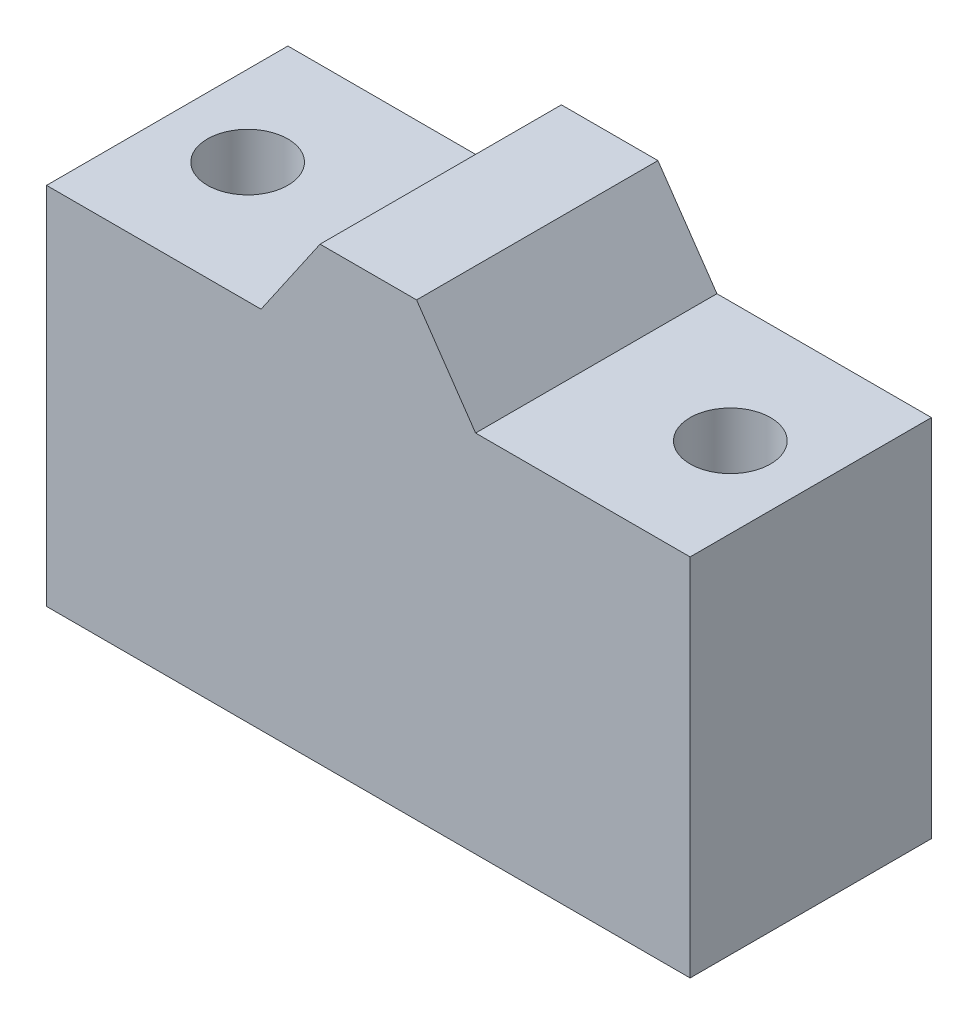
ISO-10303-21;
HEADER;
FILE_DESCRIPTION(('STEP AP214'),'2;1');
FILE_NAME('part.step','',(''),(''),'','','');
FILE_SCHEMA(('AUTOMOTIVE_DESIGN { 1 0 10303 214 1 1 1 1 }'));
ENDSEC;
DATA;
#1=APPLICATION_CONTEXT('core data for automotive mechanical design processes');
#2=APPLICATION_PROTOCOL_DEFINITION('international standard','automotive_design',2000,#1);
#3=PRODUCT_CONTEXT('',#1,'mechanical');
#4=PRODUCT('Part','Part','',(#3));
#5=PRODUCT_RELATED_PRODUCT_CATEGORY('part','',(#4));
#6=PRODUCT_DEFINITION_FORMATION('','',#4);
#7=PRODUCT_DEFINITION_CONTEXT('part definition',#1,'design');
#8=PRODUCT_DEFINITION('design','',#6,#7);
#9=PRODUCT_DEFINITION_SHAPE('','',#8);
#10=(LENGTH_UNIT() NAMED_UNIT(*) SI_UNIT(.MILLI.,.METRE.));
#11=(NAMED_UNIT(*) PLANE_ANGLE_UNIT() SI_UNIT($,.RADIAN.));
#12=(NAMED_UNIT(*) SI_UNIT($,.STERADIAN.) SOLID_ANGLE_UNIT());
#13=UNCERTAINTY_MEASURE_WITH_UNIT(LENGTH_MEASURE(1.E-05),#10,'distance_accuracy_value','');
#14=(GEOMETRIC_REPRESENTATION_CONTEXT(3) GLOBAL_UNCERTAINTY_ASSIGNED_CONTEXT((#13)) GLOBAL_UNIT_ASSIGNED_CONTEXT((#10,
#11,#12)) REPRESENTATION_CONTEXT('',''));
#15=CARTESIAN_POINT('',(0.,0.,0.));
#16=DIRECTION('',(0.,0.,1.));
#17=DIRECTION('',(1.,0.,0.));
#18=AXIS2_PLACEMENT_3D('',#15,#16,#17);
#19=CARTESIAN_POINT('',(0.,68.,45.));
#20=DIRECTION('',(1.,0.,0.));
#21=DIRECTION('',(0.,1.,0.));
#22=AXIS2_PLACEMENT_3D('',#19,#20,#21);
#23=PLANE('',#22);
#24=DIRECTION('',(0.,-1.,0.));
#25=VECTOR('',#24,1.);
#26=CARTESIAN_POINT('',(0.,68.,0.));
#27=LINE('',#26,#25);
#28=CARTESIAN_POINT('',(0.,68.,0.));
#29=VERTEX_POINT('',#28);
#30=CARTESIAN_POINT('',(0.,0.,0.));
#31=VERTEX_POINT('',#30);
#32=EDGE_CURVE('E129',#29,#31,#27,.T.);
#33=ORIENTED_EDGE('',*,*,#32,.T.);
#34=DIRECTION('',(0.,0.,-1.));
#35=VECTOR('',#34,1.);
#36=CARTESIAN_POINT('',(0.,0.,45.));
#37=LINE('',#36,#35);
#38=CARTESIAN_POINT('',(0.,0.,45.));
#39=VERTEX_POINT('',#38);
#40=EDGE_CURVE('E11',#39,#31,#37,.T.);
#41=ORIENTED_EDGE('',*,*,#40,.F.);
#42=DIRECTION('',(0.,-1.,0.));
#43=VECTOR('',#42,1.);
#44=CARTESIAN_POINT('',(0.,68.,45.));
#45=LINE('',#44,#43);
#46=CARTESIAN_POINT('',(0.,68.,45.));
#47=VERTEX_POINT('',#46);
#48=EDGE_CURVE('E144',#47,#39,#45,.T.);
#49=ORIENTED_EDGE('',*,*,#48,.F.);
#50=DIRECTION('',(0.,0.,-1.));
#51=VECTOR('',#50,1.);
#52=CARTESIAN_POINT('',(0.,68.,45.));
#53=LINE('',#52,#51);
#54=EDGE_CURVE('E125',#47,#29,#53,.T.);
#55=ORIENTED_EDGE('',*,*,#54,.T.);
#56=EDGE_LOOP('',(#33,#41,#49,#55));
#57=FACE_BOUND('',#56,.T.);
#58=ADVANCED_FACE('F33',(#57),#23,.F.);
#59=CARTESIAN_POINT('',(0.,0.,45.));
#60=DIRECTION('',(0.,1.,0.));
#61=DIRECTION('',(0.,0.,1.));
#62=AXIS2_PLACEMENT_3D('',#59,#60,#61);
#63=PLANE('',#62);
#64=CARTESIAN_POINT('',(15.0000000000001,0.,22.5));
#65=DIRECTION('',(0.,1.,0.));
#66=DIRECTION('',(-1.,0.,0.));
#67=AXIS2_PLACEMENT_3D('',#64,#65,#66);
#68=CIRCLE('',#67,7.5);
#69=CARTESIAN_POINT('',(7.50000000000008,0.,22.5));
#70=VERTEX_POINT('',#69);
#71=EDGE_CURVE('E180',#70,#70,#68,.T.);
#72=ORIENTED_EDGE('',*,*,#71,.T.);
#73=EDGE_LOOP('',(#72));
#74=FACE_BOUND('',#73,.T.);
#75=CARTESIAN_POINT('',(105.,0.,22.5));
#76=DIRECTION('',(0.,1.,0.));
#77=DIRECTION('',(-1.,0.,0.));
#78=AXIS2_PLACEMENT_3D('',#75,#76,#77);
#79=CIRCLE('',#78,7.5);
#80=CARTESIAN_POINT('',(97.5000000000001,0.,22.5));
#81=VERTEX_POINT('',#80);
#82=EDGE_CURVE('E133',#81,#81,#79,.T.);
#83=ORIENTED_EDGE('',*,*,#82,.T.);
#84=EDGE_LOOP('',(#83));
#85=FACE_BOUND('',#84,.T.);
#86=DIRECTION('',(1.,0.,0.));
#87=VECTOR('',#86,1.);
#88=CARTESIAN_POINT('',(0.,0.,0.));
#89=LINE('',#88,#87);
#90=CARTESIAN_POINT('',(120.,0.,0.));
#91=VERTEX_POINT('',#90);
#92=EDGE_CURVE('E132',#31,#91,#89,.T.);
#93=ORIENTED_EDGE('',*,*,#92,.T.);
#94=DIRECTION('',(0.,0.,-1.));
#95=VECTOR('',#94,1.);
#96=CARTESIAN_POINT('',(120.,0.,45.));
#97=LINE('',#96,#95);
#98=CARTESIAN_POINT('',(120.,0.,45.));
#99=VERTEX_POINT('',#98);
#100=EDGE_CURVE('E41',#99,#91,#97,.T.);
#101=ORIENTED_EDGE('',*,*,#100,.F.);
#102=DIRECTION('',(1.,0.,0.));
#103=VECTOR('',#102,1.);
#104=CARTESIAN_POINT('',(0.,0.,45.));
#105=LINE('',#104,#103);
#106=EDGE_CURVE('E92',#39,#99,#105,.T.);
#107=ORIENTED_EDGE('',*,*,#106,.F.);
#108=ORIENTED_EDGE('',*,*,#40,.T.);
#109=EDGE_LOOP('',(#93,#101,#107,#108));
#110=FACE_BOUND('',#109,.T.);
#111=ADVANCED_FACE('F189',(#74,#85,#110),#63,.F.);
#112=CARTESIAN_POINT('',(120.,0.,45.));
#113=DIRECTION('',(-1.,0.,0.));
#114=DIRECTION('',(0.,0.,1.));
#115=AXIS2_PLACEMENT_3D('',#112,#113,#114);
#116=PLANE('',#115);
#117=DIRECTION('',(0.,1.,0.));
#118=VECTOR('',#117,1.);
#119=CARTESIAN_POINT('',(120.,0.,0.));
#120=LINE('',#119,#118);
#121=CARTESIAN_POINT('',(120.,68.,0.));
#122=VERTEX_POINT('',#121);
#123=EDGE_CURVE('E135',#91,#122,#120,.T.);
#124=ORIENTED_EDGE('',*,*,#123,.T.);
#125=DIRECTION('',(0.,0.,-1.));
#126=VECTOR('',#125,1.);
#127=CARTESIAN_POINT('',(120.,68.,45.));
#128=LINE('',#127,#126);
#129=CARTESIAN_POINT('',(120.,68.,45.));
#130=VERTEX_POINT('',#129);
#131=EDGE_CURVE('E151',#130,#122,#128,.T.);
#132=ORIENTED_EDGE('',*,*,#131,.F.);
#133=DIRECTION('',(0.,1.,0.));
#134=VECTOR('',#133,1.);
#135=CARTESIAN_POINT('',(120.,0.,45.));
#136=LINE('',#135,#134);
#137=EDGE_CURVE('E159',#99,#130,#136,.T.);
#138=ORIENTED_EDGE('',*,*,#137,.F.);
#139=ORIENTED_EDGE('',*,*,#100,.T.);
#140=EDGE_LOOP('',(#124,#132,#138,#139));
#141=FACE_BOUND('',#140,.T.);
#142=ADVANCED_FACE('F157',(#141),#116,.F.);
#143=CARTESIAN_POINT('',(120.,68.,45.));
#144=DIRECTION('',(0.,-1.,0.));
#145=DIRECTION('',(1.,0.,0.));
#146=AXIS2_PLACEMENT_3D('',#143,#144,#145);
#147=PLANE('',#146);
#148=CARTESIAN_POINT('',(105.,68.0000000000001,22.5));
#149=DIRECTION('',(0.,1.,0.));
#150=DIRECTION('',(-1.,0.,0.));
#151=AXIS2_PLACEMENT_3D('',#148,#149,#150);
#152=CIRCLE('',#151,7.5);
#153=CARTESIAN_POINT('',(97.5,68.0000000000001,22.5));
#154=VERTEX_POINT('',#153);
#155=EDGE_CURVE('E177',#154,#154,#152,.T.);
#156=ORIENTED_EDGE('',*,*,#155,.F.);
#157=EDGE_LOOP('',(#156));
#158=FACE_BOUND('',#157,.T.);
#159=DIRECTION('',(-1.,0.,0.));
#160=VECTOR('',#159,1.);
#161=CARTESIAN_POINT('',(120.,68.,0.));
#162=LINE('',#161,#160);
#163=CARTESIAN_POINT('',(80.,68.,0.));
#164=VERTEX_POINT('',#163);
#165=EDGE_CURVE('E137',#122,#164,#162,.T.);
#166=ORIENTED_EDGE('',*,*,#165,.T.);
#167=DIRECTION('',(0.,0.,-1.));
#168=VECTOR('',#167,1.);
#169=CARTESIAN_POINT('',(80.,68.,45.));
#170=LINE('',#169,#168);
#171=CARTESIAN_POINT('',(80.,68.,45.));
#172=VERTEX_POINT('',#171);
#173=EDGE_CURVE('E148',#172,#164,#170,.T.);
#174=ORIENTED_EDGE('',*,*,#173,.F.);
#175=DIRECTION('',(-1.,0.,0.));
#176=VECTOR('',#175,1.);
#177=CARTESIAN_POINT('',(120.,68.,45.));
#178=LINE('',#177,#176);
#179=EDGE_CURVE('E171',#130,#172,#178,.T.);
#180=ORIENTED_EDGE('',*,*,#179,.F.);
#181=ORIENTED_EDGE('',*,*,#131,.T.);
#182=EDGE_LOOP('',(#166,#174,#180,#181));
#183=FACE_BOUND('',#182,.T.);
#184=ADVANCED_FACE('F167',(#158,#183),#147,.F.);
#185=CARTESIAN_POINT('',(80.,68.,45.));
#186=DIRECTION('',(-0.824041924199367,-0.566528822887066,0.));
#187=DIRECTION('',(0.566528822887066,-0.824041924199367,0.));
#188=AXIS2_PLACEMENT_3D('',#185,#186,#187);
#189=PLANE('',#188);
#190=DIRECTION('',(-0.566528822887066,0.824041924199367,0.));
#191=VECTOR('',#190,1.);
#192=CARTESIAN_POINT('',(80.,68.,0.));
#193=LINE('',#192,#191);
#194=CARTESIAN_POINT('',(69.,84.,0.));
#195=VERTEX_POINT('',#194);
#196=EDGE_CURVE('E139',#164,#195,#193,.T.);
#197=ORIENTED_EDGE('',*,*,#196,.T.);
#198=DIRECTION('',(0.,0.,-1.));
#199=VECTOR('',#198,1.);
#200=CARTESIAN_POINT('',(69.,84.,45.));
#201=LINE('',#200,#199);
#202=CARTESIAN_POINT('',(69.,84.,45.));
#203=VERTEX_POINT('',#202);
#204=EDGE_CURVE('E120',#203,#195,#201,.T.);
#205=ORIENTED_EDGE('',*,*,#204,.F.);
#206=DIRECTION('',(-0.566528822887066,0.824041924199367,0.));
#207=VECTOR('',#206,1.);
#208=CARTESIAN_POINT('',(80.,68.,45.));
#209=LINE('',#208,#207);
#210=EDGE_CURVE('E111',#172,#203,#209,.T.);
#211=ORIENTED_EDGE('',*,*,#210,.F.);
#212=ORIENTED_EDGE('',*,*,#173,.T.);
#213=EDGE_LOOP('',(#197,#205,#211,#212));
#214=FACE_BOUND('',#213,.T.);
#215=ADVANCED_FACE('F170',(#214),#189,.F.);
#216=CARTESIAN_POINT('',(69.,84.,45.));
#217=DIRECTION('',(0.,-1.,0.));
#218=DIRECTION('',(0.,0.,-1.));
#219=AXIS2_PLACEMENT_3D('',#216,#217,#218);
#220=PLANE('',#219);
#221=DIRECTION('',(-1.,0.,0.));
#222=VECTOR('',#221,1.);
#223=CARTESIAN_POINT('',(69.,84.,0.));
#224=LINE('',#223,#222);
#225=CARTESIAN_POINT('',(51.,84.,0.));
#226=VERTEX_POINT('',#225);
#227=EDGE_CURVE('E119',#195,#226,#224,.T.);
#228=ORIENTED_EDGE('',*,*,#227,.T.);
#229=DIRECTION('',(0.,0.,-1.));
#230=VECTOR('',#229,1.);
#231=CARTESIAN_POINT('',(51.,84.,45.));
#232=LINE('',#231,#230);
#233=CARTESIAN_POINT('',(51.,84.,45.));
#234=VERTEX_POINT('',#233);
#235=EDGE_CURVE('E116',#234,#226,#232,.T.);
#236=ORIENTED_EDGE('',*,*,#235,.F.);
#237=DIRECTION('',(-1.,0.,0.));
#238=VECTOR('',#237,1.);
#239=CARTESIAN_POINT('',(69.,84.,45.));
#240=LINE('',#239,#238);
#241=EDGE_CURVE('E105',#203,#234,#240,.T.);
#242=ORIENTED_EDGE('',*,*,#241,.F.);
#243=ORIENTED_EDGE('',*,*,#204,.T.);
#244=EDGE_LOOP('',(#228,#236,#242,#243));
#245=FACE_BOUND('',#244,.T.);
#246=ADVANCED_FACE('F117',(#245),#220,.F.);
#247=CARTESIAN_POINT('',(51.,84.,45.));
#248=DIRECTION('',(0.824041924199367,-0.566528822887066,0.));
#249=DIRECTION('',(0.566528822887066,0.824041924199368,0.));
#250=AXIS2_PLACEMENT_3D('',#247,#248,#249);
#251=PLANE('',#250);
#252=DIRECTION('',(-0.566528822887066,-0.824041924199367,0.));
#253=VECTOR('',#252,1.);
#254=CARTESIAN_POINT('',(51.,84.,0.));
#255=LINE('',#254,#253);
#256=CARTESIAN_POINT('',(40.,68.,0.));
#257=VERTEX_POINT('',#256);
#258=EDGE_CURVE('E78',#226,#257,#255,.T.);
#259=ORIENTED_EDGE('',*,*,#258,.T.);
#260=DIRECTION('',(0.,0.,-1.));
#261=VECTOR('',#260,1.);
#262=CARTESIAN_POINT('',(40.,68.,45.));
#263=LINE('',#262,#261);
#264=CARTESIAN_POINT('',(40.,68.,45.));
#265=VERTEX_POINT('',#264);
#266=EDGE_CURVE('E121',#265,#257,#263,.T.);
#267=ORIENTED_EDGE('',*,*,#266,.F.);
#268=DIRECTION('',(-0.566528822887066,-0.824041924199367,0.));
#269=VECTOR('',#268,1.);
#270=CARTESIAN_POINT('',(51.,84.,45.));
#271=LINE('',#270,#269);
#272=EDGE_CURVE('E109',#234,#265,#271,.T.);
#273=ORIENTED_EDGE('',*,*,#272,.F.);
#274=ORIENTED_EDGE('',*,*,#235,.T.);
#275=EDGE_LOOP('',(#259,#267,#273,#274));
#276=FACE_BOUND('',#275,.T.);
#277=ADVANCED_FACE('F123',(#276),#251,.F.);
#278=CARTESIAN_POINT('',(40.,68.,45.));
#279=DIRECTION('',(0.,-1.,0.));
#280=DIRECTION('',(0.,0.,-1.));
#281=AXIS2_PLACEMENT_3D('',#278,#279,#280);
#282=PLANE('',#281);
#283=CARTESIAN_POINT('',(15.,68.,22.5));
#284=DIRECTION('',(0.,1.,0.));
#285=DIRECTION('',(-1.,0.,0.));
#286=AXIS2_PLACEMENT_3D('',#283,#284,#285);
#287=CIRCLE('',#286,7.5);
#288=CARTESIAN_POINT('',(7.50000000000005,68.,22.5));
#289=VERTEX_POINT('',#288);
#290=EDGE_CURVE('E183',#289,#289,#287,.T.);
#291=ORIENTED_EDGE('',*,*,#290,.F.);
#292=EDGE_LOOP('',(#291));
#293=FACE_BOUND('',#292,.T.);
#294=DIRECTION('',(-1.,0.,0.));
#295=VECTOR('',#294,1.);
#296=CARTESIAN_POINT('',(40.,68.,0.));
#297=LINE('',#296,#295);
#298=EDGE_CURVE('E84',#257,#29,#297,.T.);
#299=ORIENTED_EDGE('',*,*,#298,.T.);
#300=ORIENTED_EDGE('',*,*,#54,.F.);
#301=DIRECTION('',(-1.,0.,0.));
#302=VECTOR('',#301,1.);
#303=CARTESIAN_POINT('',(40.,68.,45.));
#304=LINE('',#303,#302);
#305=EDGE_CURVE('E49',#265,#47,#304,.T.);
#306=ORIENTED_EDGE('',*,*,#305,.F.);
#307=ORIENTED_EDGE('',*,*,#266,.T.);
#308=EDGE_LOOP('',(#299,#300,#306,#307));
#309=FACE_BOUND('',#308,.T.);
#310=ADVANCED_FACE('F199',(#293,#309),#282,.F.);
#311=CARTESIAN_POINT('',(0.,0.,45.));
#312=DIRECTION('',(0.,0.,1.));
#313=DIRECTION('',(1.,0.,0.));
#314=AXIS2_PLACEMENT_3D('',#311,#312,#313);
#315=PLANE('',#314);
#316=ORIENTED_EDGE('',*,*,#48,.T.);
#317=ORIENTED_EDGE('',*,*,#106,.T.);
#318=ORIENTED_EDGE('',*,*,#137,.T.);
#319=ORIENTED_EDGE('',*,*,#179,.T.);
#320=ORIENTED_EDGE('',*,*,#210,.T.);
#321=ORIENTED_EDGE('',*,*,#241,.T.);
#322=ORIENTED_EDGE('',*,*,#272,.T.);
#323=ORIENTED_EDGE('',*,*,#305,.T.);
#324=EDGE_LOOP('',(#316,#317,#318,#319,#320,#321,#322,#323));
#325=FACE_BOUND('',#324,.T.);
#326=ADVANCED_FACE('F107',(#325),#315,.T.);
#327=CARTESIAN_POINT('',(0.,0.,0.));
#328=DIRECTION('',(0.,0.,1.));
#329=DIRECTION('',(1.,0.,0.));
#330=AXIS2_PLACEMENT_3D('',#327,#328,#329);
#331=PLANE('',#330);
#332=ORIENTED_EDGE('',*,*,#32,.F.);
#333=ORIENTED_EDGE('',*,*,#298,.F.);
#334=ORIENTED_EDGE('',*,*,#258,.F.);
#335=ORIENTED_EDGE('',*,*,#227,.F.);
#336=ORIENTED_EDGE('',*,*,#196,.F.);
#337=ORIENTED_EDGE('',*,*,#165,.F.);
#338=ORIENTED_EDGE('',*,*,#123,.F.);
#339=ORIENTED_EDGE('',*,*,#92,.F.);
#340=EDGE_LOOP('',(#332,#333,#334,#335,#336,#337,#338,#339));
#341=FACE_BOUND('',#340,.T.);
#342=ADVANCED_FACE('F163',(#341),#331,.F.);
#343=CARTESIAN_POINT('',(105.,0.,22.5));
#344=DIRECTION('',(0.,1.,0.));
#345=DIRECTION('',(-1.,0.,0.));
#346=AXIS2_PLACEMENT_3D('',#343,#344,#345);
#347=CYLINDRICAL_SURFACE('',#346,7.5);
#348=ORIENTED_EDGE('',*,*,#82,.F.);
#349=EDGE_LOOP('',(#348));
#350=FACE_BOUND('',#349,.T.);
#351=ORIENTED_EDGE('',*,*,#155,.T.);
#352=EDGE_LOOP('',(#351));
#353=FACE_BOUND('',#352,.T.);
#354=ADVANCED_FACE('F195',(#350,#353),#347,.F.);
#355=CARTESIAN_POINT('',(15.0000000000001,0.,22.5));
#356=DIRECTION('',(0.,1.,0.));
#357=DIRECTION('',(-1.,0.,0.));
#358=AXIS2_PLACEMENT_3D('',#355,#356,#357);
#359=CYLINDRICAL_SURFACE('',#358,7.5);
#360=ORIENTED_EDGE('',*,*,#71,.F.);
#361=EDGE_LOOP('',(#360));
#362=FACE_BOUND('',#361,.T.);
#363=ORIENTED_EDGE('',*,*,#290,.T.);
#364=EDGE_LOOP('',(#363));
#365=FACE_BOUND('',#364,.T.);
#366=ADVANCED_FACE('F192',(#362,#365),#359,.F.);
#367=CLOSED_SHELL('',(#58,#111,#142,#184,#215,#246,#277,#310,#326,#342,#354,#366));
#368=MANIFOLD_SOLID_BREP('B2',#367);
#369=ADVANCED_BREP_SHAPE_REPRESENTATION('',(#18,#368),#14);
#370=SHAPE_DEFINITION_REPRESENTATION(#9,#369);
ENDSEC;
END-ISO-10303-21;
